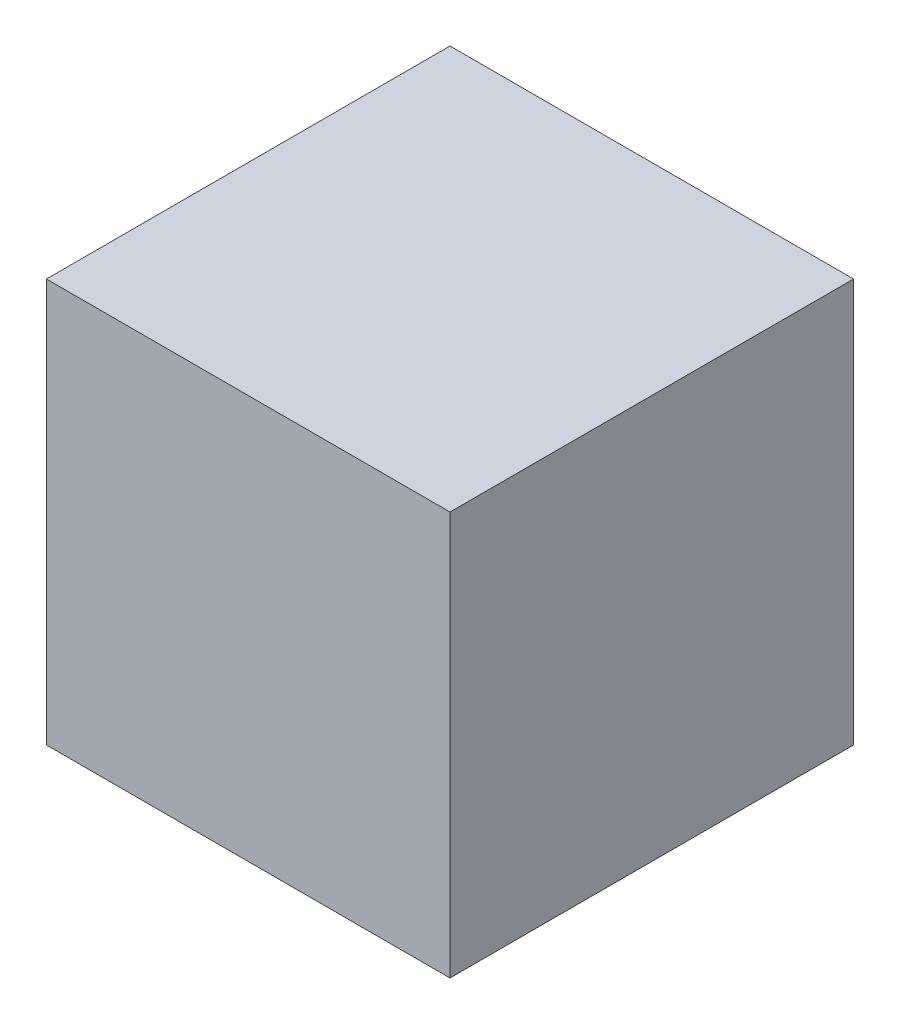
ISO-10303-21;
HEADER;
FILE_DESCRIPTION(('STEP AP214'),'2;1');
FILE_NAME('part.step','',(''),(''),'','','');
FILE_SCHEMA(('AUTOMOTIVE_DESIGN { 1 0 10303 214 1 1 1 1 }'));
ENDSEC;
DATA;
#1=APPLICATION_CONTEXT('core data for automotive mechanical design processes');
#2=APPLICATION_PROTOCOL_DEFINITION('international standard','automotive_design',2000,#1);
#3=PRODUCT_CONTEXT('',#1,'mechanical');
#4=PRODUCT('Part','Part','',(#3));
#5=PRODUCT_RELATED_PRODUCT_CATEGORY('part','',(#4));
#6=PRODUCT_DEFINITION_FORMATION('','',#4);
#7=PRODUCT_DEFINITION_CONTEXT('part definition',#1,'design');
#8=PRODUCT_DEFINITION('design','',#6,#7);
#9=PRODUCT_DEFINITION_SHAPE('','',#8);
#10=(LENGTH_UNIT() NAMED_UNIT(*) SI_UNIT(.MILLI.,.METRE.));
#11=(NAMED_UNIT(*) PLANE_ANGLE_UNIT() SI_UNIT($,.RADIAN.));
#12=(NAMED_UNIT(*) SI_UNIT($,.STERADIAN.) SOLID_ANGLE_UNIT());
#13=UNCERTAINTY_MEASURE_WITH_UNIT(LENGTH_MEASURE(1.E-05),#10,'distance_accuracy_value','');
#14=(GEOMETRIC_REPRESENTATION_CONTEXT(3) GLOBAL_UNCERTAINTY_ASSIGNED_CONTEXT((#13)) GLOBAL_UNIT_ASSIGNED_CONTEXT((#10,
#11,#12)) REPRESENTATION_CONTEXT('',''));
#15=CARTESIAN_POINT('',(0.,0.,0.));
#16=DIRECTION('',(0.,0.,1.));
#17=DIRECTION('',(1.,0.,0.));
#18=AXIS2_PLACEMENT_3D('',#15,#16,#17);
#19=CARTESIAN_POINT('',(50.,50.,50.));
#20=DIRECTION('',(-1.,0.,0.));
#21=DIRECTION('',(0.,0.,1.));
#22=AXIS2_PLACEMENT_3D('',#19,#20,#21);
#23=PLANE('',#22);
#24=DIRECTION('',(0.,0.,-1.));
#25=VECTOR('',#24,1.);
#26=CARTESIAN_POINT('',(50.,-50.,50.));
#27=LINE('',#26,#25);
#28=CARTESIAN_POINT('',(50.,-50.,50.));
#29=VERTEX_POINT('',#28);
#30=CARTESIAN_POINT('',(50.,-50.,-50.));
#31=VERTEX_POINT('',#30);
#32=EDGE_CURVE('E104',#29,#31,#27,.T.);
#33=ORIENTED_EDGE('',*,*,#32,.T.);
#34=DIRECTION('',(0.,-1.,0.));
#35=VECTOR('',#34,1.);
#36=CARTESIAN_POINT('',(50.,50.,-50.));
#37=LINE('',#36,#35);
#38=CARTESIAN_POINT('',(50.,50.,-50.));
#39=VERTEX_POINT('',#38);
#40=EDGE_CURVE('E11',#39,#31,#37,.T.);
#41=ORIENTED_EDGE('',*,*,#40,.F.);
#42=DIRECTION('',(0.,0.,-1.));
#43=VECTOR('',#42,1.);
#44=CARTESIAN_POINT('',(50.,50.,50.));
#45=LINE('',#44,#43);
#46=CARTESIAN_POINT('',(50.,50.,50.));
#47=VERTEX_POINT('',#46);
#48=EDGE_CURVE('E92',#47,#39,#45,.T.);
#49=ORIENTED_EDGE('',*,*,#48,.F.);
#50=DIRECTION('',(0.,-1.,0.));
#51=VECTOR('',#50,1.);
#52=CARTESIAN_POINT('',(50.,50.,50.));
#53=LINE('',#52,#51);
#54=EDGE_CURVE('E100',#47,#29,#53,.T.);
#55=ORIENTED_EDGE('',*,*,#54,.T.);
#56=EDGE_LOOP('',(#33,#41,#49,#55));
#57=FACE_BOUND('',#56,.T.);
#58=ADVANCED_FACE('F41',(#57),#23,.F.);
#59=CARTESIAN_POINT('',(-50.,50.,-50.));
#60=DIRECTION('',(0.,0.,1.));
#61=DIRECTION('',(1.,0.,0.));
#62=AXIS2_PLACEMENT_3D('',#59,#60,#61);
#63=PLANE('',#62);
#64=DIRECTION('',(-1.,0.,0.));
#65=VECTOR('',#64,1.);
#66=CARTESIAN_POINT('',(-50.,-50.,-50.));
#67=LINE('',#66,#65);
#68=CARTESIAN_POINT('',(-50.,-50.,-50.));
#69=VERTEX_POINT('',#68);
#70=EDGE_CURVE('E96',#31,#69,#67,.T.);
#71=ORIENTED_EDGE('',*,*,#70,.T.);
#72=DIRECTION('',(0.,-1.,0.));
#73=VECTOR('',#72,1.);
#74=CARTESIAN_POINT('',(-50.,50.,-50.));
#75=LINE('',#74,#73);
#76=CARTESIAN_POINT('',(-50.,50.,-50.));
#77=VERTEX_POINT('',#76);
#78=EDGE_CURVE('E49',#77,#69,#75,.T.);
#79=ORIENTED_EDGE('',*,*,#78,.F.);
#80=DIRECTION('',(-1.,0.,0.));
#81=VECTOR('',#80,1.);
#82=CARTESIAN_POINT('',(-50.,50.,-50.));
#83=LINE('',#82,#81);
#84=EDGE_CURVE('E87',#39,#77,#83,.T.);
#85=ORIENTED_EDGE('',*,*,#84,.F.);
#86=ORIENTED_EDGE('',*,*,#40,.T.);
#87=EDGE_LOOP('',(#71,#79,#85,#86));
#88=FACE_BOUND('',#87,.T.);
#89=ADVANCED_FACE('F95',(#88),#63,.F.);
#90=CARTESIAN_POINT('',(-50.,50.,50.));
#91=DIRECTION('',(1.,0.,0.));
#92=DIRECTION('',(0.,0.,-1.));
#93=AXIS2_PLACEMENT_3D('',#90,#91,#92);
#94=PLANE('',#93);
#95=DIRECTION('',(0.,0.,1.));
#96=VECTOR('',#95,1.);
#97=CARTESIAN_POINT('',(-50.,-50.,50.));
#98=LINE('',#97,#96);
#99=CARTESIAN_POINT('',(-50.,-50.,50.));
#100=VERTEX_POINT('',#99);
#101=EDGE_CURVE('E74',#69,#100,#98,.T.);
#102=ORIENTED_EDGE('',*,*,#101,.T.);
#103=DIRECTION('',(0.,-1.,0.));
#104=VECTOR('',#103,1.);
#105=CARTESIAN_POINT('',(-50.,50.,50.));
#106=LINE('',#105,#104);
#107=CARTESIAN_POINT('',(-50.,50.,50.));
#108=VERTEX_POINT('',#107);
#109=EDGE_CURVE('E97',#108,#100,#106,.T.);
#110=ORIENTED_EDGE('',*,*,#109,.F.);
#111=DIRECTION('',(0.,0.,1.));
#112=VECTOR('',#111,1.);
#113=CARTESIAN_POINT('',(-50.,50.,50.));
#114=LINE('',#113,#112);
#115=EDGE_CURVE('E90',#77,#108,#114,.T.);
#116=ORIENTED_EDGE('',*,*,#115,.F.);
#117=ORIENTED_EDGE('',*,*,#78,.T.);
#118=EDGE_LOOP('',(#102,#110,#116,#117));
#119=FACE_BOUND('',#118,.T.);
#120=ADVANCED_FACE('F98',(#119),#94,.F.);
#121=CARTESIAN_POINT('',(-50.,50.,50.));
#122=DIRECTION('',(0.,0.,-1.));
#123=DIRECTION('',(-1.,0.,0.));
#124=AXIS2_PLACEMENT_3D('',#121,#122,#123);
#125=PLANE('',#124);
#126=DIRECTION('',(1.,0.,0.));
#127=VECTOR('',#126,1.);
#128=CARTESIAN_POINT('',(-50.,-50.,50.));
#129=LINE('',#128,#127);
#130=EDGE_CURVE('E80',#100,#29,#129,.T.);
#131=ORIENTED_EDGE('',*,*,#130,.T.);
#132=ORIENTED_EDGE('',*,*,#54,.F.);
#133=DIRECTION('',(1.,0.,0.));
#134=VECTOR('',#133,1.);
#135=CARTESIAN_POINT('',(-50.,50.,50.));
#136=LINE('',#135,#134);
#137=EDGE_CURVE('E57',#108,#47,#136,.T.);
#138=ORIENTED_EDGE('',*,*,#137,.F.);
#139=ORIENTED_EDGE('',*,*,#109,.T.);
#140=EDGE_LOOP('',(#131,#132,#138,#139));
#141=FACE_BOUND('',#140,.T.);
#142=ADVANCED_FACE('F111',(#141),#125,.F.);
#143=CARTESIAN_POINT('',(0.,50.,0.));
#144=DIRECTION('',(0.,-1.,0.));
#145=DIRECTION('',(0.,0.,-1.));
#146=AXIS2_PLACEMENT_3D('',#143,#144,#145);
#147=PLANE('',#146);
#148=ORIENTED_EDGE('',*,*,#48,.T.);
#149=ORIENTED_EDGE('',*,*,#84,.T.);
#150=ORIENTED_EDGE('',*,*,#115,.T.);
#151=ORIENTED_EDGE('',*,*,#137,.T.);
#152=EDGE_LOOP('',(#148,#149,#150,#151));
#153=FACE_BOUND('',#152,.T.);
#154=ADVANCED_FACE('F88',(#153),#147,.F.);
#155=CARTESIAN_POINT('',(0.,-50.,0.));
#156=DIRECTION('',(0.,-1.,0.));
#157=DIRECTION('',(0.,0.,-1.));
#158=AXIS2_PLACEMENT_3D('',#155,#156,#157);
#159=PLANE('',#158);
#160=ORIENTED_EDGE('',*,*,#32,.F.);
#161=ORIENTED_EDGE('',*,*,#130,.F.);
#162=ORIENTED_EDGE('',*,*,#101,.F.);
#163=ORIENTED_EDGE('',*,*,#70,.F.);
#164=EDGE_LOOP('',(#160,#161,#162,#163));
#165=FACE_BOUND('',#164,.T.);
#166=ADVANCED_FACE('F114',(#165),#159,.T.);
#167=CLOSED_SHELL('',(#58,#89,#120,#142,#154,#166));
#168=MANIFOLD_SOLID_BREP('B2',#167);
#169=ADVANCED_BREP_SHAPE_REPRESENTATION('',(#18,#168),#14);
#170=SHAPE_DEFINITION_REPRESENTATION(#9,#169);
ENDSEC;
END-ISO-10303-21;
